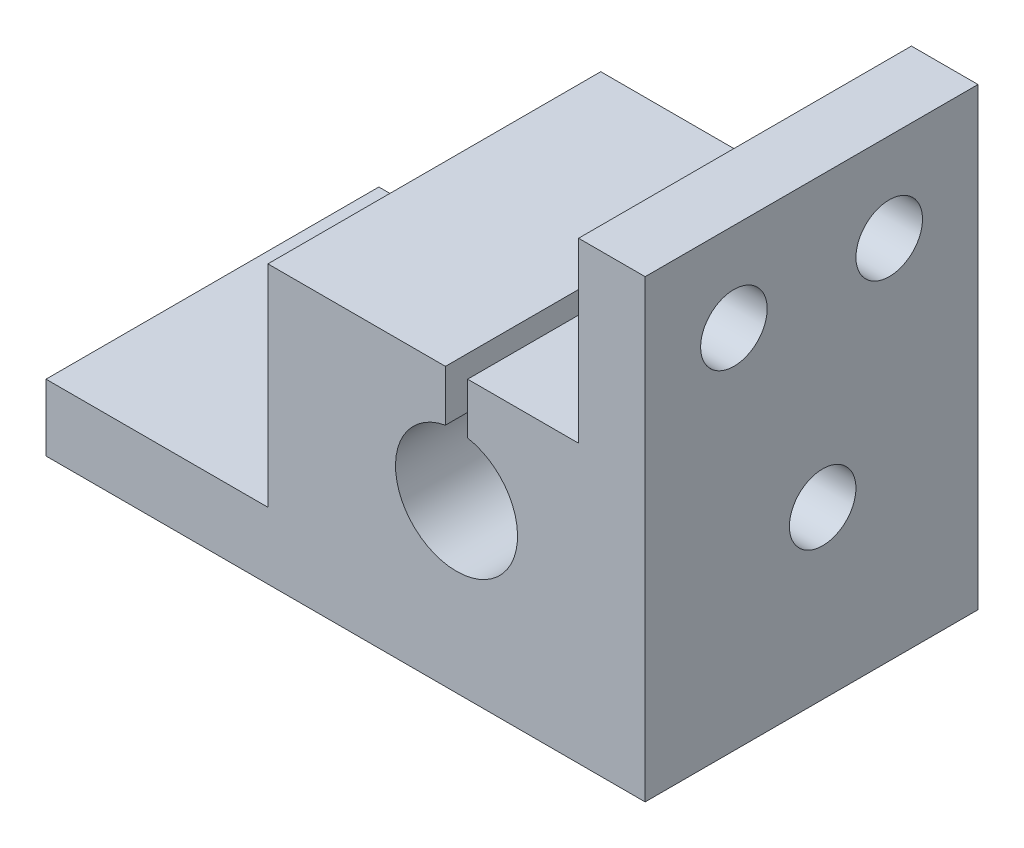
ISO-10303-21;
HEADER;
FILE_DESCRIPTION(('STEP AP214'),'2;1');
FILE_NAME('part.step','',(''),(''),'','','');
FILE_SCHEMA(('AUTOMOTIVE_DESIGN { 1 0 10303 214 1 1 1 1 }'));
ENDSEC;
DATA;
#1=APPLICATION_CONTEXT('core data for automotive mechanical design processes');
#2=APPLICATION_PROTOCOL_DEFINITION('international standard','automotive_design',2000,#1);
#3=PRODUCT_CONTEXT('',#1,'mechanical');
#4=PRODUCT('Part','Part','',(#3));
#5=PRODUCT_RELATED_PRODUCT_CATEGORY('part','',(#4));
#6=PRODUCT_DEFINITION_FORMATION('','',#4);
#7=PRODUCT_DEFINITION_CONTEXT('part definition',#1,'design');
#8=PRODUCT_DEFINITION('design','',#6,#7);
#9=PRODUCT_DEFINITION_SHAPE('','',#8);
#10=(LENGTH_UNIT() NAMED_UNIT(*) SI_UNIT(.MILLI.,.METRE.));
#11=(NAMED_UNIT(*) PLANE_ANGLE_UNIT() SI_UNIT($,.RADIAN.));
#12=(NAMED_UNIT(*) SI_UNIT($,.STERADIAN.) SOLID_ANGLE_UNIT());
#13=UNCERTAINTY_MEASURE_WITH_UNIT(LENGTH_MEASURE(1.E-05),#10,'distance_accuracy_value','');
#14=(GEOMETRIC_REPRESENTATION_CONTEXT(3) GLOBAL_UNCERTAINTY_ASSIGNED_CONTEXT((#13)) GLOBAL_UNIT_ASSIGNED_CONTEXT((#10,
#11,#12)) REPRESENTATION_CONTEXT('',''));
#15=CARTESIAN_POINT('',(0.,0.,0.));
#16=DIRECTION('',(0.,0.,1.));
#17=DIRECTION('',(1.,0.,0.));
#18=AXIS2_PLACEMENT_3D('',#15,#16,#17);
#19=CARTESIAN_POINT('',(0.,12.5,0.));
#20=DIRECTION('',(0.,1.,0.));
#21=DIRECTION('',(0.,0.,1.));
#22=AXIS2_PLACEMENT_3D('',#19,#20,#21);
#23=PLANE('',#22);
#24=DIRECTION('',(1.,0.,0.));
#25=VECTOR('',#24,1.);
#26=CARTESIAN_POINT('',(0.,12.5,7.5));
#27=LINE('',#26,#25);
#28=CARTESIAN_POINT('',(0.5,12.5,7.5));
#29=VERTEX_POINT('',#28);
#30=CARTESIAN_POINT('',(5.5,12.5,7.5));
#31=VERTEX_POINT('',#30);
#32=EDGE_CURVE('E62',#29,#31,#27,.T.);
#33=ORIENTED_EDGE('',*,*,#32,.T.);
#34=DIRECTION('',(0.,0.,1.));
#35=VECTOR('',#34,1.);
#36=CARTESIAN_POINT('',(5.5,12.5,7.5));
#37=LINE('',#36,#35);
#38=CARTESIAN_POINT('',(5.5,12.5,-7.5));
#39=VERTEX_POINT('',#38);
#40=EDGE_CURVE('E57',#39,#31,#37,.T.);
#41=ORIENTED_EDGE('',*,*,#40,.F.);
#42=DIRECTION('',(1.,0.,0.));
#43=VECTOR('',#42,1.);
#44=CARTESIAN_POINT('',(0.,12.5,-7.5));
#45=LINE('',#44,#43);
#46=CARTESIAN_POINT('',(0.5,12.5,-7.5));
#47=VERTEX_POINT('',#46);
#48=EDGE_CURVE('E225',#47,#39,#45,.T.);
#49=ORIENTED_EDGE('',*,*,#48,.F.);
#50=DIRECTION('',(0.,0.,-1.));
#51=VECTOR('',#50,1.);
#52=CARTESIAN_POINT('',(0.5,12.5,0.));
#53=LINE('',#52,#51);
#54=EDGE_CURVE('E11',#29,#47,#53,.T.);
#55=ORIENTED_EDGE('',*,*,#54,.F.);
#56=EDGE_LOOP('',(#33,#41,#49,#55));
#57=FACE_BOUND('',#56,.T.);
#58=ADVANCED_FACE('F35',(#57),#23,.T.);
#59=CARTESIAN_POINT('',(-8.5,12.5,7.5));
#60=VERTEX_POINT('',#59);
#61=CARTESIAN_POINT('',(-0.5,12.5,7.5));
#62=VERTEX_POINT('',#61);
#63=EDGE_CURVE('E222',#60,#62,#27,.T.);
#64=ORIENTED_EDGE('',*,*,#63,.T.);
#65=DIRECTION('',(0.,0.,-1.));
#66=VECTOR('',#65,1.);
#67=CARTESIAN_POINT('',(-0.5,12.5,0.));
#68=LINE('',#67,#66);
#69=CARTESIAN_POINT('',(-0.499999999999999,12.5,-7.5));
#70=VERTEX_POINT('',#69);
#71=EDGE_CURVE('E49',#62,#70,#68,.T.);
#72=ORIENTED_EDGE('',*,*,#71,.T.);
#73=CARTESIAN_POINT('',(-8.5,12.5,-7.5));
#74=VERTEX_POINT('',#73);
#75=EDGE_CURVE('E226',#74,#70,#45,.T.);
#76=ORIENTED_EDGE('',*,*,#75,.F.);
#77=DIRECTION('',(0.,0.,-1.));
#78=VECTOR('',#77,1.);
#79=CARTESIAN_POINT('',(-8.5,12.5,0.));
#80=LINE('',#79,#78);
#81=EDGE_CURVE('E229',#60,#74,#80,.T.);
#82=ORIENTED_EDGE('',*,*,#81,.F.);
#83=EDGE_LOOP('',(#64,#72,#76,#82));
#84=FACE_BOUND('',#83,.T.);
#85=ADVANCED_FACE('F272',(#84),#23,.T.);
#86=CARTESIAN_POINT('',(0.,12.5,7.5));
#87=DIRECTION('',(0.,0.,-1.));
#88=DIRECTION('',(-1.,0.,0.));
#89=AXIS2_PLACEMENT_3D('',#86,#87,#88);
#90=PLANE('',#89);
#91=ORIENTED_EDGE('',*,*,#32,.F.);
#92=DIRECTION('',(0.,-1.,0.));
#93=VECTOR('',#92,1.);
#94=CARTESIAN_POINT('',(0.5,12.5,7.5));
#95=LINE('',#94,#93);
#96=CARTESIAN_POINT('',(0.499999999999999,10.204163456598,7.5));
#97=VERTEX_POINT('',#96);
#98=EDGE_CURVE('E215',#29,#97,#95,.T.);
#99=ORIENTED_EDGE('',*,*,#98,.T.);
#100=CARTESIAN_POINT('',(0.,7.5,7.5));
#101=DIRECTION('',(0.,0.,-1.));
#102=DIRECTION('',(-1.,0.,0.));
#103=AXIS2_PLACEMENT_3D('',#100,#101,#102);
#104=CIRCLE('',#103,2.75);
#105=CARTESIAN_POINT('',(-0.499999999999999,10.204163456598,7.5));
#106=VERTEX_POINT('',#105);
#107=EDGE_CURVE('E218',#97,#106,#104,.T.);
#108=ORIENTED_EDGE('',*,*,#107,.T.);
#109=DIRECTION('',(0.,-1.,0.));
#110=VECTOR('',#109,1.);
#111=CARTESIAN_POINT('',(-0.5,12.5,7.5));
#112=LINE('',#111,#110);
#113=EDGE_CURVE('E212',#62,#106,#112,.T.);
#114=ORIENTED_EDGE('',*,*,#113,.F.);
#115=ORIENTED_EDGE('',*,*,#63,.F.);
#116=DIRECTION('',(0.,-1.,0.));
#117=VECTOR('',#116,1.);
#118=CARTESIAN_POINT('',(-8.5,12.5,7.5));
#119=LINE('',#118,#117);
#120=CARTESIAN_POINT('',(-8.5,3.,7.5));
#121=VERTEX_POINT('',#120);
#122=EDGE_CURVE('E232',#60,#121,#119,.T.);
#123=ORIENTED_EDGE('',*,*,#122,.T.);
#124=DIRECTION('',(1.,0.,0.));
#125=VECTOR('',#124,1.);
#126=CARTESIAN_POINT('',(-18.5,3.,7.5));
#127=LINE('',#126,#125);
#128=CARTESIAN_POINT('',(-18.5,3.,7.5));
#129=VERTEX_POINT('',#128);
#130=EDGE_CURVE('E190',#129,#121,#127,.T.);
#131=ORIENTED_EDGE('',*,*,#130,.F.);
#132=DIRECTION('',(0.,1.,0.));
#133=VECTOR('',#132,1.);
#134=CARTESIAN_POINT('',(-18.5,0.,7.5));
#135=LINE('',#134,#133);
#136=CARTESIAN_POINT('',(-18.5,0.,7.5));
#137=VERTEX_POINT('',#136);
#138=EDGE_CURVE('E178',#137,#129,#135,.T.);
#139=ORIENTED_EDGE('',*,*,#138,.F.);
#140=DIRECTION('',(1.,0.,0.));
#141=VECTOR('',#140,1.);
#142=CARTESIAN_POINT('',(0.,0.,7.5));
#143=LINE('',#142,#141);
#144=CARTESIAN_POINT('',(8.5,0.,7.5));
#145=VERTEX_POINT('',#144);
#146=EDGE_CURVE('E221',#137,#145,#143,.T.);
#147=ORIENTED_EDGE('',*,*,#146,.T.);
#148=DIRECTION('',(0.,-1.,0.));
#149=VECTOR('',#148,1.);
#150=CARTESIAN_POINT('',(8.5,12.5,7.5));
#151=LINE('',#150,#149);
#152=CARTESIAN_POINT('',(8.5,20.5,7.5));
#153=VERTEX_POINT('',#152);
#154=EDGE_CURVE('E139',#153,#145,#151,.T.);
#155=ORIENTED_EDGE('',*,*,#154,.F.);
#156=DIRECTION('',(1.,0.,0.));
#157=VECTOR('',#156,1.);
#158=CARTESIAN_POINT('',(8.5,20.5,7.5));
#159=LINE('',#158,#157);
#160=CARTESIAN_POINT('',(5.5,20.5,7.5));
#161=VERTEX_POINT('',#160);
#162=EDGE_CURVE('E155',#161,#153,#159,.T.);
#163=ORIENTED_EDGE('',*,*,#162,.F.);
#164=DIRECTION('',(0.,-1.,0.));
#165=VECTOR('',#164,1.);
#166=CARTESIAN_POINT('',(5.5,20.5,7.5));
#167=LINE('',#166,#165);
#168=EDGE_CURVE('E163',#161,#31,#167,.T.);
#169=ORIENTED_EDGE('',*,*,#168,.T.);
#170=EDGE_LOOP('',(#91,#99,#108,#114,#115,#123,#131,#139,#147,#155,#163,#169));
#171=FACE_BOUND('',#170,.T.);
#172=ADVANCED_FACE('F37',(#171),#90,.F.);
#173=CARTESIAN_POINT('',(8.5,12.5,0.));
#174=DIRECTION('',(-1.,0.,0.));
#175=DIRECTION('',(0.,0.,1.));
#176=AXIS2_PLACEMENT_3D('',#173,#174,#175);
#177=PLANE('',#176);
#178=CARTESIAN_POINT('',(8.5,16.5,3.5));
#179=DIRECTION('',(-1.,0.,0.));
#180=DIRECTION('',(0.,0.,1.));
#181=AXIS2_PLACEMENT_3D('',#178,#179,#180);
#182=CIRCLE('',#181,1.5);
#183=CARTESIAN_POINT('',(8.5,16.5,5.));
#184=VERTEX_POINT('',#183);
#185=EDGE_CURVE('E157',#184,#184,#182,.T.);
#186=ORIENTED_EDGE('',*,*,#185,.T.);
#187=EDGE_LOOP('',(#186));
#188=FACE_BOUND('',#187,.T.);
#189=CARTESIAN_POINT('',(8.5,16.5,-3.5));
#190=DIRECTION('',(-1.,0.,0.));
#191=DIRECTION('',(0.,0.,1.));
#192=AXIS2_PLACEMENT_3D('',#189,#190,#191);
#193=CIRCLE('',#192,1.5);
#194=CARTESIAN_POINT('',(8.5,16.5,-2.));
#195=VERTEX_POINT('',#194);
#196=EDGE_CURVE('E299',#195,#195,#193,.T.);
#197=ORIENTED_EDGE('',*,*,#196,.T.);
#198=EDGE_LOOP('',(#197));
#199=FACE_BOUND('',#198,.T.);
#200=CARTESIAN_POINT('',(8.5,7.5,-0.499999999999999));
#201=DIRECTION('',(-1.,0.,0.));
#202=DIRECTION('',(0.,0.,1.));
#203=AXIS2_PLACEMENT_3D('',#200,#201,#202);
#204=CIRCLE('',#203,1.5);
#205=CARTESIAN_POINT('',(8.5,7.5,1.));
#206=VERTEX_POINT('',#205);
#207=EDGE_CURVE('E197',#206,#206,#204,.T.);
#208=ORIENTED_EDGE('',*,*,#207,.T.);
#209=EDGE_LOOP('',(#208));
#210=FACE_BOUND('',#209,.T.);
#211=DIRECTION('',(0.,0.,-1.));
#212=VECTOR('',#211,1.);
#213=CARTESIAN_POINT('',(8.5,0.,0.));
#214=LINE('',#213,#212);
#215=CARTESIAN_POINT('',(8.5,0.,-7.5));
#216=VERTEX_POINT('',#215);
#217=EDGE_CURVE('E136',#145,#216,#214,.T.);
#218=ORIENTED_EDGE('',*,*,#217,.T.);
#219=DIRECTION('',(0.,-1.,0.));
#220=VECTOR('',#219,1.);
#221=CARTESIAN_POINT('',(8.5,12.5,-7.5));
#222=LINE('',#221,#220);
#223=CARTESIAN_POINT('',(8.5,20.5,-7.5));
#224=VERTEX_POINT('',#223);
#225=EDGE_CURVE('E130',#224,#216,#222,.T.);
#226=ORIENTED_EDGE('',*,*,#225,.F.);
#227=DIRECTION('',(0.,0.,-1.));
#228=VECTOR('',#227,1.);
#229=CARTESIAN_POINT('',(8.5,20.5,-7.5));
#230=LINE('',#229,#228);
#231=EDGE_CURVE('E135',#153,#224,#230,.T.);
#232=ORIENTED_EDGE('',*,*,#231,.F.);
#233=ORIENTED_EDGE('',*,*,#154,.T.);
#234=EDGE_LOOP('',(#218,#226,#232,#233));
#235=FACE_BOUND('',#234,.T.);
#236=ADVANCED_FACE('F132',(#188,#199,#210,#235),#177,.F.);
#237=CARTESIAN_POINT('',(0.,12.5,-7.5));
#238=DIRECTION('',(0.,0.,-1.));
#239=DIRECTION('',(-1.,0.,0.));
#240=AXIS2_PLACEMENT_3D('',#237,#238,#239);
#241=PLANE('',#240);
#242=DIRECTION('',(0.,-1.,0.));
#243=VECTOR('',#242,1.);
#244=CARTESIAN_POINT('',(0.499999999999992,0.,-7.5));
#245=LINE('',#244,#243);
#246=CARTESIAN_POINT('',(0.499999999999999,10.204163456598,-7.5));
#247=VERTEX_POINT('',#246);
#248=EDGE_CURVE('E206',#47,#247,#245,.T.);
#249=ORIENTED_EDGE('',*,*,#248,.F.);
#250=ORIENTED_EDGE('',*,*,#48,.T.);
#251=DIRECTION('',(0.,-1.,0.));
#252=VECTOR('',#251,1.);
#253=CARTESIAN_POINT('',(5.5,20.5,-7.5));
#254=LINE('',#253,#252);
#255=CARTESIAN_POINT('',(5.5,20.5,-7.5));
#256=VERTEX_POINT('',#255);
#257=EDGE_CURVE('E147',#256,#39,#254,.T.);
#258=ORIENTED_EDGE('',*,*,#257,.F.);
#259=DIRECTION('',(-1.,0.,0.));
#260=VECTOR('',#259,1.);
#261=CARTESIAN_POINT('',(5.5,20.5,-7.5));
#262=LINE('',#261,#260);
#263=EDGE_CURVE('E143',#224,#256,#262,.T.);
#264=ORIENTED_EDGE('',*,*,#263,.F.);
#265=ORIENTED_EDGE('',*,*,#225,.T.);
#266=DIRECTION('',(1.,0.,0.));
#267=VECTOR('',#266,1.);
#268=CARTESIAN_POINT('',(0.,0.,-7.5));
#269=LINE('',#268,#267);
#270=CARTESIAN_POINT('',(-18.5,0.,-7.5));
#271=VERTEX_POINT('',#270);
#272=EDGE_CURVE('E236',#271,#216,#269,.T.);
#273=ORIENTED_EDGE('',*,*,#272,.F.);
#274=DIRECTION('',(0.,-1.,0.));
#275=VECTOR('',#274,1.);
#276=CARTESIAN_POINT('',(-18.5,3.,-7.5));
#277=LINE('',#276,#275);
#278=CARTESIAN_POINT('',(-18.5,3.,-7.5));
#279=VERTEX_POINT('',#278);
#280=EDGE_CURVE('E182',#279,#271,#277,.T.);
#281=ORIENTED_EDGE('',*,*,#280,.F.);
#282=DIRECTION('',(1.,0.,0.));
#283=VECTOR('',#282,1.);
#284=CARTESIAN_POINT('',(-18.5,3.,-7.5));
#285=LINE('',#284,#283);
#286=CARTESIAN_POINT('',(-8.5,3.,-7.5));
#287=VERTEX_POINT('',#286);
#288=EDGE_CURVE('E185',#279,#287,#285,.T.);
#289=ORIENTED_EDGE('',*,*,#288,.T.);
#290=DIRECTION('',(0.,-1.,0.));
#291=VECTOR('',#290,1.);
#292=CARTESIAN_POINT('',(-8.5,12.5,-7.5));
#293=LINE('',#292,#291);
#294=EDGE_CURVE('E140',#74,#287,#293,.T.);
#295=ORIENTED_EDGE('',*,*,#294,.F.);
#296=ORIENTED_EDGE('',*,*,#75,.T.);
#297=DIRECTION('',(0.,-1.,0.));
#298=VECTOR('',#297,1.);
#299=CARTESIAN_POINT('',(-0.499999999999992,0.,-7.5));
#300=LINE('',#299,#298);
#301=CARTESIAN_POINT('',(-0.499999999999999,10.204163456598,-7.5));
#302=VERTEX_POINT('',#301);
#303=EDGE_CURVE('E203',#70,#302,#300,.T.);
#304=ORIENTED_EDGE('',*,*,#303,.T.);
#305=CARTESIAN_POINT('',(0.,7.5,-7.5));
#306=DIRECTION('',(0.,0.,-1.));
#307=DIRECTION('',(-1.,0.,0.));
#308=AXIS2_PLACEMENT_3D('',#305,#306,#307);
#309=CIRCLE('',#308,2.75);
#310=EDGE_CURVE('E200',#247,#302,#309,.T.);
#311=ORIENTED_EDGE('',*,*,#310,.F.);
#312=EDGE_LOOP('',(#249,#250,#258,#264,#265,#273,#281,#289,#295,#296,#304,#311));
#313=FACE_BOUND('',#312,.T.);
#314=ADVANCED_FACE('F145',(#313),#241,.T.);
#315=CARTESIAN_POINT('',(-8.5,12.5,0.));
#316=DIRECTION('',(-1.,0.,0.));
#317=DIRECTION('',(0.,0.,1.));
#318=AXIS2_PLACEMENT_3D('',#315,#316,#317);
#319=PLANE('',#318);
#320=DIRECTION('',(0.,0.,-1.));
#321=VECTOR('',#320,1.);
#322=CARTESIAN_POINT('',(-8.5,3.,7.5));
#323=LINE('',#322,#321);
#324=EDGE_CURVE('E174',#121,#287,#323,.T.);
#325=ORIENTED_EDGE('',*,*,#324,.F.);
#326=ORIENTED_EDGE('',*,*,#122,.F.);
#327=ORIENTED_EDGE('',*,*,#81,.T.);
#328=ORIENTED_EDGE('',*,*,#294,.T.);
#329=EDGE_LOOP('',(#325,#326,#327,#328));
#330=FACE_BOUND('',#329,.T.);
#331=CARTESIAN_POINT('',(-8.5,7.5,-0.499999999999999));
#332=DIRECTION('',(-1.,0.,0.));
#333=DIRECTION('',(0.,0.,1.));
#334=AXIS2_PLACEMENT_3D('',#331,#332,#333);
#335=CIRCLE('',#334,1.5);
#336=CARTESIAN_POINT('',(-8.5,7.5,1.));
#337=VERTEX_POINT('',#336);
#338=EDGE_CURVE('E193',#337,#337,#335,.T.);
#339=ORIENTED_EDGE('',*,*,#338,.F.);
#340=EDGE_LOOP('',(#339));
#341=FACE_BOUND('',#340,.T.);
#342=ADVANCED_FACE('F281',(#330,#341),#319,.T.);
#343=CARTESIAN_POINT('',(0.,0.,0.));
#344=DIRECTION('',(0.,1.,0.));
#345=DIRECTION('',(0.,0.,1.));
#346=AXIS2_PLACEMENT_3D('',#343,#344,#345);
#347=PLANE('',#346);
#348=CARTESIAN_POINT('',(-13.5,0.,0.));
#349=DIRECTION('',(0.,1.,0.));
#350=DIRECTION('',(0.,0.,1.));
#351=AXIS2_PLACEMENT_3D('',#348,#349,#350);
#352=CIRCLE('',#351,1.5);
#353=CARTESIAN_POINT('',(-13.5,0.,1.5));
#354=VERTEX_POINT('',#353);
#355=EDGE_CURVE('E171',#354,#354,#352,.T.);
#356=ORIENTED_EDGE('',*,*,#355,.T.);
#357=EDGE_LOOP('',(#356));
#358=FACE_BOUND('',#357,.T.);
#359=ORIENTED_EDGE('',*,*,#146,.F.);
#360=DIRECTION('',(0.,0.,1.));
#361=VECTOR('',#360,1.);
#362=CARTESIAN_POINT('',(-18.5,0.,-7.5));
#363=LINE('',#362,#361);
#364=EDGE_CURVE('E175',#271,#137,#363,.T.);
#365=ORIENTED_EDGE('',*,*,#364,.F.);
#366=ORIENTED_EDGE('',*,*,#272,.T.);
#367=ORIENTED_EDGE('',*,*,#217,.F.);
#368=EDGE_LOOP('',(#359,#365,#366,#367));
#369=FACE_BOUND('',#368,.T.);
#370=ADVANCED_FACE('F278',(#358,#369),#347,.F.);
#371=CARTESIAN_POINT('',(0.,7.5,12.5));
#372=DIRECTION('',(0.,0.,-1.));
#373=DIRECTION('',(-1.,0.,0.));
#374=AXIS2_PLACEMENT_3D('',#371,#372,#373);
#375=CYLINDRICAL_SURFACE('',#374,2.75);
#376=CARTESIAN_POINT('',(2.75,7.5,1.));
#377=CARTESIAN_POINT('',(2.74999553289391,7.4220270508408,0.999995036820674));
#378=CARTESIAN_POINT('',(2.74664984832556,7.34398823680063,0.993885034274786));
#379=CARTESIAN_POINT('',(2.73359531725478,7.19027258005787,0.969742314187782));
#380=CARTESIAN_POINT('',(2.72387746390221,7.11459923972906,0.951692720110077));
#381=CARTESIAN_POINT('',(2.69908175997792,6.96806040477277,0.904613769214734));
#382=CARTESIAN_POINT('',(2.68402590603009,6.8971765799675,0.875629440875726));
#383=CARTESIAN_POINT('',(2.64988699120144,6.76141624637264,0.8077689259114));
#384=CARTESIAN_POINT('',(2.63080379903718,6.69653993351553,0.768892416811621));
#385=CARTESIAN_POINT('',(2.58877435218394,6.56967137317771,0.679372893557068));
#386=CARTESIAN_POINT('',(2.56565357097934,6.5081759601769,0.628109118333411));
#387=CARTESIAN_POINT('',(2.51862762447079,6.39418614464205,0.516632188680352));
#388=CARTESIAN_POINT('',(2.49472176235856,6.34170001053448,0.456410906934984));
#389=CARTESIAN_POINT('',(2.44613124305119,6.24210519491563,0.321807798794306));
#390=CARTESIAN_POINT('',(2.42159402839635,6.19600411626677,0.246620289435558));
#391=CARTESIAN_POINT('',(2.37752741687072,6.11728165747247,0.0881331298715552));
#392=CARTESIAN_POINT('',(2.35799408630603,6.08464967647791,0.00483992330818433));
#393=CARTESIAN_POINT('',(2.32814537755157,6.03609717227609,-0.162263824607325));
#394=CARTESIAN_POINT('',(2.31732653409192,6.01925285487332,-0.245710755848717));
#395=CARTESIAN_POINT('',(2.30492353478053,6.00000826788416,-0.414884164073688));
#396=CARTESIAN_POINT('',(2.30332659165822,5.99758799747776,-0.500607318911514));
#397=CARTESIAN_POINT('',(2.30916059512703,6.00658671599147,-0.658093729852789));
#398=CARTESIAN_POINT('',(2.31528177670115,6.01599729077657,-0.730033785505485));
#399=CARTESIAN_POINT('',(2.33351887542567,6.04484424025798,-0.871088078763484));
#400=CARTESIAN_POINT('',(2.34563743072956,6.06428502725226,-0.940201058282962));
#401=CARTESIAN_POINT('',(2.37471884026675,6.11290843753231,-1.07555773868773));
#402=CARTESIAN_POINT('',(2.39178172165247,6.14229456611718,-1.14170579765983));
#403=CARTESIAN_POINT('',(2.42886159364227,6.2098009743962,-1.2684721974986));
#404=CARTESIAN_POINT('',(2.44887986910388,6.24792505691845,-1.32908811462556));
#405=CARTESIAN_POINT('',(2.49334307244702,6.33867823747908,-1.45294377982219));
#406=CARTESIAN_POINT('',(2.51799359501409,6.39263907029744,-1.51513758948288));
#407=CARTESIAN_POINT('',(2.56648691782871,6.51020620828936,-1.63007617121855));
#408=CARTESIAN_POINT('',(2.59032917374526,6.57381886162662,-1.68281467420527));
#409=CARTESIAN_POINT('',(2.63638937585234,6.7140381267654,-1.78063703725313));
#410=CARTESIAN_POINT('',(2.65840123043428,6.79122036013456,-1.82500120750568));
#411=CARTESIAN_POINT('',(2.69642211220391,6.95344422164659,-1.89972502136931));
#412=CARTESIAN_POINT('',(2.71243670343128,7.03847847319571,-1.93009765186634));
#413=CARTESIAN_POINT('',(2.73537507908384,7.20560314041774,-1.9731172515579));
#414=CARTESIAN_POINT('',(2.74300133491569,7.28724120881031,-1.98714119615107));
#415=CARTESIAN_POINT('',(2.75081609737275,7.45204814685527,-2.00150899650171));
#416=CARTESIAN_POINT('',(2.75100922913374,7.53521603236789,-2.00186135917102));
#417=CARTESIAN_POINT('',(2.74429233918013,7.69220394198291,-1.98951638051903));
#418=CARTESIAN_POINT('',(2.73806095216361,7.76615627611883,-1.97806582935284));
#419=CARTESIAN_POINT('',(2.7201065477026,7.91090173026521,-1.94453446085424));
#420=CARTESIAN_POINT('',(2.70838297051789,7.98169452746372,-1.92245256001439));
#421=CARTESIAN_POINT('',(2.68013382891396,8.12007203330004,-1.8679082647443));
#422=CARTESIAN_POINT('',(2.6635032440995,8.18754432603544,-1.83521709435844));
#423=CARTESIAN_POINT('',(2.62692883380052,8.31622707762891,-1.76067804412777));
#424=CARTESIAN_POINT('',(2.60698377449004,8.37743519086002,-1.7188267525459));
#425=CARTESIAN_POINT('',(2.56300184221369,8.49907604776481,-1.62185100645769));
#426=CARTESIAN_POINT('',(2.5387564598654,8.55867122088779,-1.56576961471427));
#427=CARTESIAN_POINT('',(2.49032836693211,8.66805413999383,-1.44462690888345));
#428=CARTESIAN_POINT('',(2.46614574384712,8.71783196696366,-1.37955662451297));
#429=CARTESIAN_POINT('',(2.41863034974007,8.80981050679895,-1.23632105825382));
#430=CARTESIAN_POINT('',(2.39549649377281,8.85116579672796,-1.15754030877454));
#431=CARTESIAN_POINT('',(2.35557673325722,8.91962887927165,-0.992545312298827));
#432=CARTESIAN_POINT('',(2.33878162902652,8.94675734230938,-0.906342062936624));
#433=CARTESIAN_POINT('',(2.31576769108303,8.98328938456405,-0.737789012175135));
#434=CARTESIAN_POINT('',(2.30867825825265,8.99416166817435,-0.655881322941747));
#435=CARTESIAN_POINT('',(2.30343772372917,9.00223385888718,-0.491135232400116));
#436=CARTESIAN_POINT('',(2.30527941768142,8.99944478599832,-0.408297635011415));
#437=CARTESIAN_POINT('',(2.31670968294054,8.98170001222614,-0.255713288490515));
#438=CARTESIAN_POINT('',(2.32524317806448,8.96839952788391,-0.185682334973308));
#439=CARTESIAN_POINT('',(2.34762721988834,8.9323386957082,-0.0489956674915921));
#440=CARTESIAN_POINT('',(2.36147988599044,8.90957457682849,0.0176586890833149));
#441=CARTESIAN_POINT('',(2.39396641086271,8.85370854482785,0.150367755846729));
#442=CARTESIAN_POINT('',(2.41284421791643,8.8200513188859,0.216126851199319));
#443=CARTESIAN_POINT('',(2.45297719359377,8.74388744619949,0.341505330982647));
#444=CARTESIAN_POINT('',(2.47423362899283,8.701376073563,0.401121411081335));
#445=CARTESIAN_POINT('',(2.52062694545993,8.60110703838269,0.522078125252921));
#446=CARTESIAN_POINT('',(2.54585863647192,8.54201074304019,0.582278858180883));
#447=CARTESIAN_POINT('',(2.59453539642988,8.41409487950943,0.692287208793299));
#448=CARTESIAN_POINT('',(2.61797921165257,8.34526858307313,0.742087575142215));
#449=CARTESIAN_POINT('',(2.66139613447405,8.19687330645546,0.831199343214314));
#450=CARTESIAN_POINT('',(2.68123529430282,8.11703247318212,0.870127188200871));
#451=CARTESIAN_POINT('',(2.71414877932511,7.95059617944135,0.933472152452146));
#452=CARTESIAN_POINT('',(2.72724064660339,7.86401891505752,0.957926924663132));
#453=CARTESIAN_POINT('',(2.74071669432246,7.73035516522777,0.982926474999247));
#454=CARTESIAN_POINT('',(2.74418450271714,7.68459665053541,0.989315551652522));
#455=CARTESIAN_POINT('',(2.74882747533462,7.59256649478554,0.997853775806506));
#456=CARTESIAN_POINT('',(2.75000265225361,7.54629485657103,1.00000294678703));
#457=CARTESIAN_POINT('',(2.75,7.5,1.));
#458=B_SPLINE_CURVE_WITH_KNOTS('',3,(#376,#377,#378,#379,#380,#381,#382,#383,#384,#385,#386,
#387,#388,#389,#390,#391,#392,#393,#394,#395,#396,#397,#398,#399,#400,#401,#402,#403,#404,#405,
#406,#407,#408,#409,#410,#411,#412,#413,#414,#415,#416,#417,#418,#419,#420,#421,#422,#423,#424,
#425,#426,#427,#428,#429,#430,#431,#432,#433,#434,#435,#436,#437,#438,#439,#440,#441,#442,#443,
#444,#445,#446,#447,#448,#449,#450,#451,#452,#453,#454,#455,#456,#457),.UNSPECIFIED.,.T.,.F.,(4,
2,2,2,2,2,2,2,2,2,2,2,2,2,2,2,2,2,2,2,2,2,2,2,2,2,2,2,2,2,2,2,2,2,2,2,2,2,2,2,4),(0.,
0.233732365670662,0.467795818544868,0.700905752709472,0.934023286981207,1.18300734378139,
1.43221870235056,1.70547758592502,1.97852098918854,2.23435206692627,2.48982831886023,
2.70723672174195,2.92474084439227,3.14699566236442,3.36934739171625,3.62611318738823,
3.88304860020488,4.15667273405988,4.43004237689776,4.6781878937731,4.92617900379767,
5.15041519453526,5.37467424342679,5.60413212023295,5.83367560575034,6.08865618522294,
6.34389308070037,6.61822417400225,6.89215557446505,7.13941350036,7.38647200714689,
7.6009068270719,7.81542717649291,8.04330134656289,8.27129745737792,8.53429002491757,
8.79746534824315,9.06900285379735,9.33983078990054,9.47860540833467,9.61737925825842),.UNSPECIFIED.);
#459=CARTESIAN_POINT('',(2.75,7.5,1.));
#460=VERTEX_POINT('',#459);
#461=EDGE_CURVE('E39',#460,#460,#458,.T.);
#462=ORIENTED_EDGE('',*,*,#461,.T.);
#463=EDGE_LOOP('',(#462));
#464=FACE_BOUND('',#463,.T.);
#465=CARTESIAN_POINT('',(-2.75,7.5,1.));
#466=CARTESIAN_POINT('',(-2.74999553289391,7.5779729491592,0.999995036820674));
#467=CARTESIAN_POINT('',(-2.74664984832556,7.65601176319937,0.993885034274786));
#468=CARTESIAN_POINT('',(-2.73359531725477,7.80972741994213,0.969742314187782));
#469=CARTESIAN_POINT('',(-2.72387746390221,7.88540076027094,0.951692720110077));
#470=CARTESIAN_POINT('',(-2.69908175997792,8.03193959522723,0.904613769214734));
#471=CARTESIAN_POINT('',(-2.68402590603009,8.10282342003249,0.875629440875726));
#472=CARTESIAN_POINT('',(-2.64988699120144,8.23858375362736,0.8077689259114));
#473=CARTESIAN_POINT('',(-2.63080379903718,8.30346006648447,0.76889241681162));
#474=CARTESIAN_POINT('',(-2.58877435218394,8.43032862682229,0.679372893557068));
#475=CARTESIAN_POINT('',(-2.56565357097934,8.4918240398231,0.628109118333411));
#476=CARTESIAN_POINT('',(-2.51862762447079,8.60581385535795,0.516632188680351));
#477=CARTESIAN_POINT('',(-2.49472176235856,8.65829998946552,0.456410906934984));
#478=CARTESIAN_POINT('',(-2.44613124305119,8.75789480508437,0.321807798794305));
#479=CARTESIAN_POINT('',(-2.42159402839635,8.80399588373323,0.246620289435558));
#480=CARTESIAN_POINT('',(-2.37752741687072,8.88271834252753,0.0881331298715541));
#481=CARTESIAN_POINT('',(-2.35799408630603,8.91535032352209,0.00483992330818277));
#482=CARTESIAN_POINT('',(-2.32814537755157,8.96390282772392,-0.162263824607327));
#483=CARTESIAN_POINT('',(-2.31732653409192,8.98074714512668,-0.245710755848718));
#484=CARTESIAN_POINT('',(-2.30492353478053,8.99999173211584,-0.41488416407369));
#485=CARTESIAN_POINT('',(-2.30332659165822,9.00241200252224,-0.500607318911516));
#486=CARTESIAN_POINT('',(-2.30916059512703,8.99341328400853,-0.658093729852791));
#487=CARTESIAN_POINT('',(-2.31528177670115,8.98400270922343,-0.730033785505487));
#488=CARTESIAN_POINT('',(-2.33351887542567,8.95515575974201,-0.871088078763486));
#489=CARTESIAN_POINT('',(-2.34563743072956,8.93571497274773,-0.940201058282964));
#490=CARTESIAN_POINT('',(-2.37471884026675,8.88709156246769,-1.07555773868773));
#491=CARTESIAN_POINT('',(-2.39178172165247,8.85770543388282,-1.14170579765983));
#492=CARTESIAN_POINT('',(-2.42886159364227,8.7901990256038,-1.26847219749861));
#493=CARTESIAN_POINT('',(-2.44887986910388,8.75207494308155,-1.32908811462557));
#494=CARTESIAN_POINT('',(-2.49334307244702,8.66132176252092,-1.45294377982219));
#495=CARTESIAN_POINT('',(-2.51799359501409,8.60736092970256,-1.51513758948288));
#496=CARTESIAN_POINT('',(-2.56648691782871,8.48979379171064,-1.63007617121856));
#497=CARTESIAN_POINT('',(-2.59032917374526,8.42618113837338,-1.68281467420527));
#498=CARTESIAN_POINT('',(-2.63638937585234,8.2859618732346,-1.78063703725313));
#499=CARTESIAN_POINT('',(-2.65840123043428,8.20877963986544,-1.82500120750568));
#500=CARTESIAN_POINT('',(-2.69642211220391,8.04655577835341,-1.89972502136931));
#501=CARTESIAN_POINT('',(-2.71243670343128,7.96152152680429,-1.93009765186634));
#502=CARTESIAN_POINT('',(-2.73537507908384,7.79439685958225,-1.9731172515579));
#503=CARTESIAN_POINT('',(-2.74300133491569,7.71275879118968,-1.98714119615107));
#504=CARTESIAN_POINT('',(-2.75081609737275,7.54795185314472,-2.00150899650171));
#505=CARTESIAN_POINT('',(-2.75100922913374,7.46478396763211,-2.00186135917102));
#506=CARTESIAN_POINT('',(-2.74429233918013,7.30779605801709,-1.98951638051903));
#507=CARTESIAN_POINT('',(-2.73806095216361,7.23384372388117,-1.97806582935284));
#508=CARTESIAN_POINT('',(-2.7201065477026,7.08909826973479,-1.94453446085424));
#509=CARTESIAN_POINT('',(-2.70838297051789,7.01830547253628,-1.92245256001439));
#510=CARTESIAN_POINT('',(-2.68013382891396,6.87992796669995,-1.8679082647443));
#511=CARTESIAN_POINT('',(-2.6635032440995,6.81245567396456,-1.83521709435844));
#512=CARTESIAN_POINT('',(-2.62692883380052,6.68377292237109,-1.76067804412777));
#513=CARTESIAN_POINT('',(-2.60698377449004,6.62256480913998,-1.7188267525459));
#514=CARTESIAN_POINT('',(-2.56300184221369,6.50092395223519,-1.62185100645769));
#515=CARTESIAN_POINT('',(-2.5387564598654,6.44132877911221,-1.56576961471427));
#516=CARTESIAN_POINT('',(-2.49032836693211,6.33194586000617,-1.44462690888345));
#517=CARTESIAN_POINT('',(-2.46614574384712,6.28216803303634,-1.37955662451297));
#518=CARTESIAN_POINT('',(-2.41863034974007,6.19018949320105,-1.23632105825381));
#519=CARTESIAN_POINT('',(-2.39549649377281,6.14883420327204,-1.15754030877454));
#520=CARTESIAN_POINT('',(-2.35557673325722,6.08037112072834,-0.992545312298826));
#521=CARTESIAN_POINT('',(-2.33878162902652,6.05324265769062,-0.906342062936623));
#522=CARTESIAN_POINT('',(-2.31576769108303,6.01671061543595,-0.737789012175134));
#523=CARTESIAN_POINT('',(-2.30867825825265,6.00583833182565,-0.655881322941746));
#524=CARTESIAN_POINT('',(-2.30343772372917,5.99776614111282,-0.491135232400115));
#525=CARTESIAN_POINT('',(-2.30527941768142,6.00055521400168,-0.408297635011414));
#526=CARTESIAN_POINT('',(-2.31670968294054,6.01829998777386,-0.255713288490514));
#527=CARTESIAN_POINT('',(-2.32524317806448,6.03160047211609,-0.185682334973307));
#528=CARTESIAN_POINT('',(-2.34762721988834,6.0676613042918,-0.0489956674915905));
#529=CARTESIAN_POINT('',(-2.36147988599044,6.09042542317151,0.0176586890833159));
#530=CARTESIAN_POINT('',(-2.39396641086271,6.14629145517215,0.150367755846729));
#531=CARTESIAN_POINT('',(-2.41284421791643,6.1799486811141,0.216126851199319));
#532=CARTESIAN_POINT('',(-2.45297719359377,6.25611255380051,0.341505330982647));
#533=CARTESIAN_POINT('',(-2.47423362899283,6.29862392643699,0.401121411081335));
#534=CARTESIAN_POINT('',(-2.52062694545993,6.39889296161731,0.522078125252921));
#535=CARTESIAN_POINT('',(-2.54585863647192,6.45798925695981,0.582278858180884));
#536=CARTESIAN_POINT('',(-2.59453539642988,6.58590512049057,0.692287208793299));
#537=CARTESIAN_POINT('',(-2.61797921165257,6.65473141692687,0.742087575142215));
#538=CARTESIAN_POINT('',(-2.66139613447405,6.80312669354454,0.831199343214315));
#539=CARTESIAN_POINT('',(-2.68123529430282,6.88296752681788,0.870127188200871));
#540=CARTESIAN_POINT('',(-2.71414877932511,7.04940382055865,0.933472152452146));
#541=CARTESIAN_POINT('',(-2.72724064660339,7.13598108494248,0.957926924663131));
#542=CARTESIAN_POINT('',(-2.74071669432246,7.26964483477224,0.982926474999247));
#543=CARTESIAN_POINT('',(-2.74418450271714,7.31540334946459,0.989315551652522));
#544=CARTESIAN_POINT('',(-2.74882747533462,7.40743350521446,0.997853775806506));
#545=CARTESIAN_POINT('',(-2.75000265225361,7.45370514342897,1.00000294678703));
#546=CARTESIAN_POINT('',(-2.75,7.5,1.));
#547=B_SPLINE_CURVE_WITH_KNOTS('',3,(#465,#466,#467,#468,#469,#470,#471,#472,#473,#474,#475,
#476,#477,#478,#479,#480,#481,#482,#483,#484,#485,#486,#487,#488,#489,#490,#491,#492,#493,#494,
#495,#496,#497,#498,#499,#500,#501,#502,#503,#504,#505,#506,#507,#508,#509,#510,#511,#512,#513,
#514,#515,#516,#517,#518,#519,#520,#521,#522,#523,#524,#525,#526,#527,#528,#529,#530,#531,#532,
#533,#534,#535,#536,#537,#538,#539,#540,#541,#542,#543,#544,#545,#546),.UNSPECIFIED.,.T.,.F.,(4,
2,2,2,2,2,2,2,2,2,2,2,2,2,2,2,2,2,2,2,2,2,2,2,2,2,2,2,2,2,2,2,2,2,2,2,2,2,2,2,4),(0.,
0.233732365670663,0.467795818544869,0.700905752709472,0.934023286981207,1.18300734378139,
1.43221870235056,1.70547758592502,1.97852098918855,2.23435206692627,2.48982831886023,
2.70723672174195,2.92474084439228,3.14699566236442,3.36934739171625,3.62611318738823,
3.88304860020488,4.15667273405988,4.43004237689776,4.6781878937731,4.92617900379767,
5.15041519453526,5.37467424342679,5.60413212023295,5.83367560575034,6.08865618522294,
6.34389308070037,6.61822417400225,6.89215557446505,7.13941350036,7.38647200714689,
7.6009068270719,7.81542717649291,8.04330134656289,8.27129745737792,8.53429002491757,
8.79746534824315,9.06900285379735,9.33983078990054,9.47860540833467,9.61737925825842),.UNSPECIFIED.);
#548=CARTESIAN_POINT('',(-2.75,7.5,1.));
#549=VERTEX_POINT('',#548);
#550=EDGE_CURVE('E196',#549,#549,#547,.T.);
#551=ORIENTED_EDGE('',*,*,#550,.T.);
#552=EDGE_LOOP('',(#551));
#553=FACE_BOUND('',#552,.T.);
#554=DIRECTION('',(0.,0.,-1.));
#555=VECTOR('',#554,1.);
#556=CARTESIAN_POINT('',(0.499999999999999,10.204163456598,12.5));
#557=LINE('',#556,#555);
#558=EDGE_CURVE('E210',#97,#247,#557,.T.);
#559=ORIENTED_EDGE('',*,*,#558,.T.);
#560=ORIENTED_EDGE('',*,*,#310,.T.);
#561=DIRECTION('',(0.,0.,-1.));
#562=VECTOR('',#561,1.);
#563=CARTESIAN_POINT('',(-0.499999999999999,10.204163456598,12.5));
#564=LINE('',#563,#562);
#565=EDGE_CURVE('E209',#106,#302,#564,.T.);
#566=ORIENTED_EDGE('',*,*,#565,.F.);
#567=ORIENTED_EDGE('',*,*,#107,.F.);
#568=EDGE_LOOP('',(#559,#560,#566,#567));
#569=FACE_BOUND('',#568,.T.);
#570=ADVANCED_FACE('F247',(#464,#553,#569),#375,.F.);
#571=CARTESIAN_POINT('',(0.499999999999992,0.,12.5));
#572=DIRECTION('',(1.,0.,0.));
#573=DIRECTION('',(0.,1.,0.));
#574=AXIS2_PLACEMENT_3D('',#571,#572,#573);
#575=PLANE('',#574);
#576=ORIENTED_EDGE('',*,*,#54,.T.);
#577=ORIENTED_EDGE('',*,*,#248,.T.);
#578=ORIENTED_EDGE('',*,*,#558,.F.);
#579=ORIENTED_EDGE('',*,*,#98,.F.);
#580=EDGE_LOOP('',(#576,#577,#578,#579));
#581=FACE_BOUND('',#580,.T.);
#582=ADVANCED_FACE('F260',(#581),#575,.F.);
#583=CARTESIAN_POINT('',(-0.499999999999992,0.,12.5));
#584=DIRECTION('',(1.,0.,0.));
#585=DIRECTION('',(0.,1.,0.));
#586=AXIS2_PLACEMENT_3D('',#583,#584,#585);
#587=PLANE('',#586);
#588=ORIENTED_EDGE('',*,*,#113,.T.);
#589=ORIENTED_EDGE('',*,*,#565,.T.);
#590=ORIENTED_EDGE('',*,*,#303,.F.);
#591=ORIENTED_EDGE('',*,*,#71,.F.);
#592=EDGE_LOOP('',(#588,#589,#590,#591));
#593=FACE_BOUND('',#592,.T.);
#594=ADVANCED_FACE('F263',(#593),#587,.T.);
#595=CARTESIAN_POINT('',(11.5,7.5,-0.499999999999999));
#596=DIRECTION('',(-1.,0.,0.));
#597=DIRECTION('',(0.,0.,1.));
#598=AXIS2_PLACEMENT_3D('',#595,#596,#597);
#599=CYLINDRICAL_SURFACE('',#598,1.5);
#600=ORIENTED_EDGE('',*,*,#338,.T.);
#601=EDGE_LOOP('',(#600));
#602=FACE_BOUND('',#601,.T.);
#603=ORIENTED_EDGE('',*,*,#550,.F.);
#604=EDGE_LOOP('',(#603));
#605=FACE_BOUND('',#604,.T.);
#606=ADVANCED_FACE('F257',(#602,#605),#599,.F.);
#607=ORIENTED_EDGE('',*,*,#461,.F.);
#608=EDGE_LOOP('',(#607));
#609=FACE_BOUND('',#608,.T.);
#610=ORIENTED_EDGE('',*,*,#207,.F.);
#611=EDGE_LOOP('',(#610));
#612=FACE_BOUND('',#611,.T.);
#613=ADVANCED_FACE('F251',(#609,#612),#599,.F.);
#614=CARTESIAN_POINT('',(-18.5,3.,7.5));
#615=DIRECTION('',(0.,-1.,0.));
#616=DIRECTION('',(0.,0.,-1.));
#617=AXIS2_PLACEMENT_3D('',#614,#615,#616);
#618=PLANE('',#617);
#619=CARTESIAN_POINT('',(-13.5,3.,0.));
#620=DIRECTION('',(0.,1.,0.));
#621=DIRECTION('',(0.,0.,1.));
#622=AXIS2_PLACEMENT_3D('',#619,#620,#621);
#623=CIRCLE('',#622,1.5);
#624=CARTESIAN_POINT('',(-13.5,3.,1.5));
#625=VERTEX_POINT('',#624);
#626=EDGE_CURVE('E168',#625,#625,#623,.T.);
#627=ORIENTED_EDGE('',*,*,#626,.F.);
#628=EDGE_LOOP('',(#627));
#629=FACE_BOUND('',#628,.T.);
#630=ORIENTED_EDGE('',*,*,#324,.T.);
#631=ORIENTED_EDGE('',*,*,#288,.F.);
#632=DIRECTION('',(0.,0.,-1.));
#633=VECTOR('',#632,1.);
#634=CARTESIAN_POINT('',(-18.5,3.,7.5));
#635=LINE('',#634,#633);
#636=EDGE_CURVE('E180',#129,#279,#635,.T.);
#637=ORIENTED_EDGE('',*,*,#636,.F.);
#638=ORIENTED_EDGE('',*,*,#130,.T.);
#639=EDGE_LOOP('',(#630,#631,#637,#638));
#640=FACE_BOUND('',#639,.T.);
#641=ADVANCED_FACE('F256',(#629,#640),#618,.F.);
#642=CARTESIAN_POINT('',(-18.5,0.,0.));
#643=DIRECTION('',(-1.,0.,0.));
#644=DIRECTION('',(0.,0.,1.));
#645=AXIS2_PLACEMENT_3D('',#642,#643,#644);
#646=PLANE('',#645);
#647=ORIENTED_EDGE('',*,*,#364,.T.);
#648=ORIENTED_EDGE('',*,*,#138,.T.);
#649=ORIENTED_EDGE('',*,*,#636,.T.);
#650=ORIENTED_EDGE('',*,*,#280,.T.);
#651=EDGE_LOOP('',(#647,#648,#649,#650));
#652=FACE_BOUND('',#651,.T.);
#653=ADVANCED_FACE('F326',(#652),#646,.T.);
#654=CARTESIAN_POINT('',(-13.5,-3.,0.));
#655=DIRECTION('',(0.,1.,0.));
#656=DIRECTION('',(0.,0.,1.));
#657=AXIS2_PLACEMENT_3D('',#654,#655,#656);
#658=CYLINDRICAL_SURFACE('',#657,1.5);
#659=ORIENTED_EDGE('',*,*,#626,.T.);
#660=EDGE_LOOP('',(#659));
#661=FACE_BOUND('',#660,.T.);
#662=ORIENTED_EDGE('',*,*,#355,.F.);
#663=EDGE_LOOP('',(#662));
#664=FACE_BOUND('',#663,.T.);
#665=ADVANCED_FACE('F316',(#661,#664),#658,.F.);
#666=CARTESIAN_POINT('',(5.5,20.5,7.5));
#667=DIRECTION('',(1.,0.,0.));
#668=DIRECTION('',(0.,0.,-1.));
#669=AXIS2_PLACEMENT_3D('',#666,#667,#668);
#670=PLANE('',#669);
#671=CARTESIAN_POINT('',(5.5,16.5,3.5));
#672=DIRECTION('',(-1.,0.,0.));
#673=DIRECTION('',(0.,0.,1.));
#674=AXIS2_PLACEMENT_3D('',#671,#672,#673);
#675=CIRCLE('',#674,1.5);
#676=CARTESIAN_POINT('',(5.5,16.5,5.));
#677=VERTEX_POINT('',#676);
#678=EDGE_CURVE('E303',#677,#677,#675,.T.);
#679=ORIENTED_EDGE('',*,*,#678,.F.);
#680=EDGE_LOOP('',(#679));
#681=FACE_BOUND('',#680,.T.);
#682=CARTESIAN_POINT('',(5.5,16.5,-3.5));
#683=DIRECTION('',(-1.,0.,0.));
#684=DIRECTION('',(0.,0.,1.));
#685=AXIS2_PLACEMENT_3D('',#682,#683,#684);
#686=CIRCLE('',#685,1.5);
#687=CARTESIAN_POINT('',(5.5,16.5,-2.));
#688=VERTEX_POINT('',#687);
#689=EDGE_CURVE('E305',#688,#688,#686,.T.);
#690=ORIENTED_EDGE('',*,*,#689,.F.);
#691=EDGE_LOOP('',(#690));
#692=FACE_BOUND('',#691,.T.);
#693=ORIENTED_EDGE('',*,*,#40,.T.);
#694=ORIENTED_EDGE('',*,*,#168,.F.);
#695=DIRECTION('',(0.,0.,1.));
#696=VECTOR('',#695,1.);
#697=CARTESIAN_POINT('',(5.5,20.5,7.5));
#698=LINE('',#697,#696);
#699=EDGE_CURVE('E150',#256,#161,#698,.T.);
#700=ORIENTED_EDGE('',*,*,#699,.F.);
#701=ORIENTED_EDGE('',*,*,#257,.T.);
#702=EDGE_LOOP('',(#693,#694,#700,#701));
#703=FACE_BOUND('',#702,.T.);
#704=ADVANCED_FACE('F313',(#681,#692,#703),#670,.F.);
#705=CARTESIAN_POINT('',(0.,20.5,0.));
#706=DIRECTION('',(0.,-1.,0.));
#707=DIRECTION('',(0.,0.,-1.));
#708=AXIS2_PLACEMENT_3D('',#705,#706,#707);
#709=PLANE('',#708);
#710=ORIENTED_EDGE('',*,*,#231,.T.);
#711=ORIENTED_EDGE('',*,*,#263,.T.);
#712=ORIENTED_EDGE('',*,*,#699,.T.);
#713=ORIENTED_EDGE('',*,*,#162,.T.);
#714=EDGE_LOOP('',(#710,#711,#712,#713));
#715=FACE_BOUND('',#714,.T.);
#716=ADVANCED_FACE('F153',(#715),#709,.F.);
#717=CARTESIAN_POINT('',(11.5,16.5,-3.5));
#718=DIRECTION('',(-1.,0.,0.));
#719=DIRECTION('',(0.,0.,1.));
#720=AXIS2_PLACEMENT_3D('',#717,#718,#719);
#721=CYLINDRICAL_SURFACE('',#720,1.5);
#722=ORIENTED_EDGE('',*,*,#689,.T.);
#723=EDGE_LOOP('',(#722));
#724=FACE_BOUND('',#723,.T.);
#725=ORIENTED_EDGE('',*,*,#196,.F.);
#726=EDGE_LOOP('',(#725));
#727=FACE_BOUND('',#726,.T.);
#728=ADVANCED_FACE('F311',(#724,#727),#721,.F.);
#729=CARTESIAN_POINT('',(11.5,16.5,3.5));
#730=DIRECTION('',(-1.,0.,0.));
#731=DIRECTION('',(0.,0.,1.));
#732=AXIS2_PLACEMENT_3D('',#729,#730,#731);
#733=CYLINDRICAL_SURFACE('',#732,1.5);
#734=ORIENTED_EDGE('',*,*,#678,.T.);
#735=EDGE_LOOP('',(#734));
#736=FACE_BOUND('',#735,.T.);
#737=ORIENTED_EDGE('',*,*,#185,.F.);
#738=EDGE_LOOP('',(#737));
#739=FACE_BOUND('',#738,.T.);
#740=ADVANCED_FACE('F459',(#736,#739),#733,.F.);
#741=CLOSED_SHELL('',(#58,#85,#172,#236,#314,#342,#370,#570,#582,#594,#606,#613,#641,#653,#665,
#704,#716,#728,#740));
#742=MANIFOLD_SOLID_BREP('B2',#741);
#743=ADVANCED_BREP_SHAPE_REPRESENTATION('',(#18,#742),#14);
#744=SHAPE_DEFINITION_REPRESENTATION(#9,#743);
ENDSEC;
END-ISO-10303-21;
